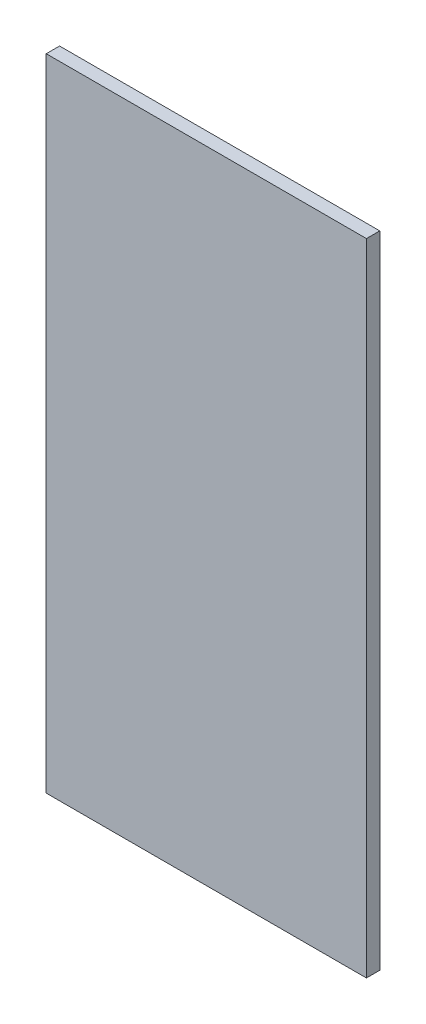
ISO-10303-21;
HEADER;
FILE_DESCRIPTION(('STEP AP214'),'2;1');
FILE_NAME('part.step','',(''),(''),'','','');
FILE_SCHEMA(('AUTOMOTIVE_DESIGN { 1 0 10303 214 1 1 1 1 }'));
ENDSEC;
DATA;
#1=APPLICATION_CONTEXT('core data for automotive mechanical design processes');
#2=APPLICATION_PROTOCOL_DEFINITION('international standard','automotive_design',2000,#1);
#3=PRODUCT_CONTEXT('',#1,'mechanical');
#4=PRODUCT('Part','Part','',(#3));
#5=PRODUCT_RELATED_PRODUCT_CATEGORY('part','',(#4));
#6=PRODUCT_DEFINITION_FORMATION('','',#4);
#7=PRODUCT_DEFINITION_CONTEXT('part definition',#1,'design');
#8=PRODUCT_DEFINITION('design','',#6,#7);
#9=PRODUCT_DEFINITION_SHAPE('','',#8);
#10=(LENGTH_UNIT() NAMED_UNIT(*) SI_UNIT(.MILLI.,.METRE.));
#11=(NAMED_UNIT(*) PLANE_ANGLE_UNIT() SI_UNIT($,.RADIAN.));
#12=(NAMED_UNIT(*) SI_UNIT($,.STERADIAN.) SOLID_ANGLE_UNIT());
#13=UNCERTAINTY_MEASURE_WITH_UNIT(LENGTH_MEASURE(1.E-05),#10,'distance_accuracy_value','');
#14=(GEOMETRIC_REPRESENTATION_CONTEXT(3) GLOBAL_UNCERTAINTY_ASSIGNED_CONTEXT((#13)) GLOBAL_UNIT_ASSIGNED_CONTEXT((#10,
#11,#12)) REPRESENTATION_CONTEXT('',''));
#15=CARTESIAN_POINT('',(0.,0.,0.));
#16=DIRECTION('',(0.,0.,1.));
#17=DIRECTION('',(1.,0.,0.));
#18=AXIS2_PLACEMENT_3D('',#15,#16,#17);
#19=CARTESIAN_POINT('',(0.,0.,25.4));
#20=DIRECTION('',(1.,0.,0.));
#21=DIRECTION('',(0.,0.,-1.));
#22=AXIS2_PLACEMENT_3D('',#19,#20,#21);
#23=PLANE('',#22);
#24=DIRECTION('',(0.,-1.,0.));
#25=VECTOR('',#24,1.);
#26=CARTESIAN_POINT('',(0.,0.,0.));
#27=LINE('',#26,#25);
#28=CARTESIAN_POINT('',(0.,0.,0.));
#29=VERTEX_POINT('',#28);
#30=CARTESIAN_POINT('',(0.,-1219.2,0.));
#31=VERTEX_POINT('',#30);
#32=EDGE_CURVE('E96',#29,#31,#27,.T.);
#33=ORIENTED_EDGE('',*,*,#32,.T.);
#34=DIRECTION('',(0.,0.,-1.));
#35=VECTOR('',#34,1.);
#36=CARTESIAN_POINT('',(0.,-1219.2,25.4));
#37=LINE('',#36,#35);
#38=CARTESIAN_POINT('',(0.,-1219.2,25.4));
#39=VERTEX_POINT('',#38);
#40=EDGE_CURVE('E11',#39,#31,#37,.T.);
#41=ORIENTED_EDGE('',*,*,#40,.F.);
#42=DIRECTION('',(0.,-1.,0.));
#43=VECTOR('',#42,1.);
#44=CARTESIAN_POINT('',(0.,0.,25.4));
#45=LINE('',#44,#43);
#46=CARTESIAN_POINT('',(0.,0.,25.4));
#47=VERTEX_POINT('',#46);
#48=EDGE_CURVE('E84',#47,#39,#45,.T.);
#49=ORIENTED_EDGE('',*,*,#48,.F.);
#50=DIRECTION('',(0.,0.,-1.));
#51=VECTOR('',#50,1.);
#52=CARTESIAN_POINT('',(0.,0.,25.4));
#53=LINE('',#52,#51);
#54=EDGE_CURVE('E92',#47,#29,#53,.T.);
#55=ORIENTED_EDGE('',*,*,#54,.T.);
#56=EDGE_LOOP('',(#33,#41,#49,#55));
#57=FACE_BOUND('',#56,.T.);
#58=ADVANCED_FACE('F33',(#57),#23,.F.);
#59=CARTESIAN_POINT('',(0.,-1219.2,25.4));
#60=DIRECTION('',(0.,1.,0.));
#61=DIRECTION('',(0.,0.,1.));
#62=AXIS2_PLACEMENT_3D('',#59,#60,#61);
#63=PLANE('',#62);
#64=DIRECTION('',(1.,0.,0.));
#65=VECTOR('',#64,1.);
#66=CARTESIAN_POINT('',(0.,-1219.2,0.));
#67=LINE('',#66,#65);
#68=CARTESIAN_POINT('',(609.6,-1219.2,0.));
#69=VERTEX_POINT('',#68);
#70=EDGE_CURVE('E88',#31,#69,#67,.T.);
#71=ORIENTED_EDGE('',*,*,#70,.T.);
#72=DIRECTION('',(0.,0.,-1.));
#73=VECTOR('',#72,1.);
#74=CARTESIAN_POINT('',(609.6,-1219.2,25.4));
#75=LINE('',#74,#73);
#76=CARTESIAN_POINT('',(609.6,-1219.2,25.4));
#77=VERTEX_POINT('',#76);
#78=EDGE_CURVE('E41',#77,#69,#75,.T.);
#79=ORIENTED_EDGE('',*,*,#78,.F.);
#80=DIRECTION('',(1.,0.,0.));
#81=VECTOR('',#80,1.);
#82=CARTESIAN_POINT('',(0.,-1219.2,25.4));
#83=LINE('',#82,#81);
#84=EDGE_CURVE('E79',#39,#77,#83,.T.);
#85=ORIENTED_EDGE('',*,*,#84,.F.);
#86=ORIENTED_EDGE('',*,*,#40,.T.);
#87=EDGE_LOOP('',(#71,#79,#85,#86));
#88=FACE_BOUND('',#87,.T.);
#89=ADVANCED_FACE('F87',(#88),#63,.F.);
#90=CARTESIAN_POINT('',(609.6,0.,25.4));
#91=DIRECTION('',(-1.,0.,0.));
#92=DIRECTION('',(0.,0.,1.));
#93=AXIS2_PLACEMENT_3D('',#90,#91,#92);
#94=PLANE('',#93);
#95=DIRECTION('',(0.,1.,0.));
#96=VECTOR('',#95,1.);
#97=CARTESIAN_POINT('',(609.6,0.,0.));
#98=LINE('',#97,#96);
#99=CARTESIAN_POINT('',(609.6,0.,0.));
#100=VERTEX_POINT('',#99);
#101=EDGE_CURVE('E66',#69,#100,#98,.T.);
#102=ORIENTED_EDGE('',*,*,#101,.T.);
#103=DIRECTION('',(0.,0.,-1.));
#104=VECTOR('',#103,1.);
#105=CARTESIAN_POINT('',(609.6,0.,25.4));
#106=LINE('',#105,#104);
#107=CARTESIAN_POINT('',(609.6,0.,25.4));
#108=VERTEX_POINT('',#107);
#109=EDGE_CURVE('E89',#108,#100,#106,.T.);
#110=ORIENTED_EDGE('',*,*,#109,.F.);
#111=DIRECTION('',(0.,1.,0.));
#112=VECTOR('',#111,1.);
#113=CARTESIAN_POINT('',(609.6,0.,25.4));
#114=LINE('',#113,#112);
#115=EDGE_CURVE('E82',#77,#108,#114,.T.);
#116=ORIENTED_EDGE('',*,*,#115,.F.);
#117=ORIENTED_EDGE('',*,*,#78,.T.);
#118=EDGE_LOOP('',(#102,#110,#116,#117));
#119=FACE_BOUND('',#118,.T.);
#120=ADVANCED_FACE('F90',(#119),#94,.F.);
#121=CARTESIAN_POINT('',(0.,0.,25.4));
#122=DIRECTION('',(0.,-1.,0.));
#123=DIRECTION('',(0.,0.,-1.));
#124=AXIS2_PLACEMENT_3D('',#121,#122,#123);
#125=PLANE('',#124);
#126=DIRECTION('',(-1.,0.,0.));
#127=VECTOR('',#126,1.);
#128=CARTESIAN_POINT('',(0.,0.,0.));
#129=LINE('',#128,#127);
#130=EDGE_CURVE('E72',#100,#29,#129,.T.);
#131=ORIENTED_EDGE('',*,*,#130,.T.);
#132=ORIENTED_EDGE('',*,*,#54,.F.);
#133=DIRECTION('',(-1.,0.,0.));
#134=VECTOR('',#133,1.);
#135=CARTESIAN_POINT('',(0.,0.,25.4));
#136=LINE('',#135,#134);
#137=EDGE_CURVE('E49',#108,#47,#136,.T.);
#138=ORIENTED_EDGE('',*,*,#137,.F.);
#139=ORIENTED_EDGE('',*,*,#109,.T.);
#140=EDGE_LOOP('',(#131,#132,#138,#139));
#141=FACE_BOUND('',#140,.T.);
#142=ADVANCED_FACE('F103',(#141),#125,.F.);
#143=CARTESIAN_POINT('',(0.,0.,25.4));
#144=DIRECTION('',(0.,0.,1.));
#145=DIRECTION('',(1.,0.,0.));
#146=AXIS2_PLACEMENT_3D('',#143,#144,#145);
#147=PLANE('',#146);
#148=ORIENTED_EDGE('',*,*,#48,.T.);
#149=ORIENTED_EDGE('',*,*,#84,.T.);
#150=ORIENTED_EDGE('',*,*,#115,.T.);
#151=ORIENTED_EDGE('',*,*,#137,.T.);
#152=EDGE_LOOP('',(#148,#149,#150,#151));
#153=FACE_BOUND('',#152,.T.);
#154=ADVANCED_FACE('F80',(#153),#147,.T.);
#155=CARTESIAN_POINT('',(0.,0.,0.));
#156=DIRECTION('',(0.,0.,1.));
#157=DIRECTION('',(1.,0.,0.));
#158=AXIS2_PLACEMENT_3D('',#155,#156,#157);
#159=PLANE('',#158);
#160=ORIENTED_EDGE('',*,*,#32,.F.);
#161=ORIENTED_EDGE('',*,*,#130,.F.);
#162=ORIENTED_EDGE('',*,*,#101,.F.);
#163=ORIENTED_EDGE('',*,*,#70,.F.);
#164=EDGE_LOOP('',(#160,#161,#162,#163));
#165=FACE_BOUND('',#164,.T.);
#166=ADVANCED_FACE('F106',(#165),#159,.F.);
#167=CLOSED_SHELL('',(#58,#89,#120,#142,#154,#166));
#168=MANIFOLD_SOLID_BREP('B2',#167);
#169=ADVANCED_BREP_SHAPE_REPRESENTATION('',(#18,#168),#14);
#170=SHAPE_DEFINITION_REPRESENTATION(#9,#169);
ENDSEC;
END-ISO-10303-21;
